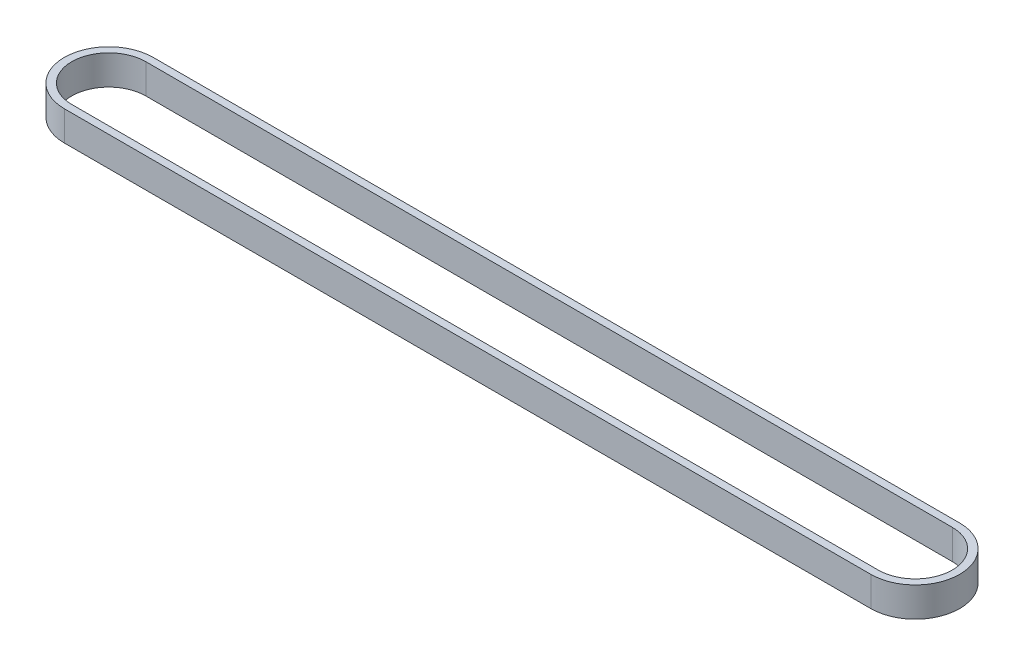
ISO-10303-21;
HEADER;
FILE_DESCRIPTION(('STEP AP214'),'2;1');
FILE_NAME('part.step','',(''),(''),'','','');
FILE_SCHEMA(('AUTOMOTIVE_DESIGN { 1 0 10303 214 1 1 1 1 }'));
ENDSEC;
DATA;
#1=APPLICATION_CONTEXT('core data for automotive mechanical design processes');
#2=APPLICATION_PROTOCOL_DEFINITION('international standard','automotive_design',2000,#1);
#3=PRODUCT_CONTEXT('',#1,'mechanical');
#4=PRODUCT('Part','Part','',(#3));
#5=PRODUCT_RELATED_PRODUCT_CATEGORY('part','',(#4));
#6=PRODUCT_DEFINITION_FORMATION('','',#4);
#7=PRODUCT_DEFINITION_CONTEXT('part definition',#1,'design');
#8=PRODUCT_DEFINITION('design','',#6,#7);
#9=PRODUCT_DEFINITION_SHAPE('','',#8);
#10=(LENGTH_UNIT() NAMED_UNIT(*) SI_UNIT(.MILLI.,.METRE.));
#11=(NAMED_UNIT(*) PLANE_ANGLE_UNIT() SI_UNIT($,.RADIAN.));
#12=(NAMED_UNIT(*) SI_UNIT($,.STERADIAN.) SOLID_ANGLE_UNIT());
#13=UNCERTAINTY_MEASURE_WITH_UNIT(LENGTH_MEASURE(1.E-05),#10,'distance_accuracy_value','');
#14=(GEOMETRIC_REPRESENTATION_CONTEXT(3) GLOBAL_UNCERTAINTY_ASSIGNED_CONTEXT((#13)) GLOBAL_UNIT_ASSIGNED_CONTEXT((#10,
#11,#12)) REPRESENTATION_CONTEXT('',''));
#15=CARTESIAN_POINT('',(0.,0.,0.));
#16=DIRECTION('',(0.,0.,1.));
#17=DIRECTION('',(1.,0.,0.));
#18=AXIS2_PLACEMENT_3D('',#15,#16,#17);
#19=CARTESIAN_POINT('',(0.,8.,0.));
#20=DIRECTION('',(0.,-1.,0.));
#21=DIRECTION('',(0.,0.,-1.));
#22=AXIS2_PLACEMENT_3D('',#19,#20,#21);
#23=CYLINDRICAL_SURFACE('',#22,11.975);
#24=CARTESIAN_POINT('',(0.,0.,0.));
#25=DIRECTION('',(0.,1.,0.));
#26=DIRECTION('',(0.,0.,1.));
#27=AXIS2_PLACEMENT_3D('',#24,#25,#26);
#28=CIRCLE('',#27,11.975);
#29=CARTESIAN_POINT('',(0.,0.,-11.975));
#30=VERTEX_POINT('',#29);
#31=CARTESIAN_POINT('',(0.,0.,11.975));
#32=VERTEX_POINT('',#31);
#33=EDGE_CURVE('E128',#30,#32,#28,.T.);
#34=ORIENTED_EDGE('',*,*,#33,.T.);
#35=DIRECTION('',(0.,-1.,0.));
#36=VECTOR('',#35,1.);
#37=CARTESIAN_POINT('',(0.,8.,11.975));
#38=LINE('',#37,#36);
#39=CARTESIAN_POINT('',(0.,8.,11.975));
#40=VERTEX_POINT('',#39);
#41=EDGE_CURVE('E11',#40,#32,#38,.T.);
#42=ORIENTED_EDGE('',*,*,#41,.F.);
#43=CARTESIAN_POINT('',(0.,8.,0.));
#44=DIRECTION('',(0.,1.,0.));
#45=DIRECTION('',(0.,0.,1.));
#46=AXIS2_PLACEMENT_3D('',#43,#44,#45);
#47=CIRCLE('',#46,11.975);
#48=CARTESIAN_POINT('',(0.,8.,-11.975));
#49=VERTEX_POINT('',#48);
#50=EDGE_CURVE('E132',#49,#40,#47,.T.);
#51=ORIENTED_EDGE('',*,*,#50,.F.);
#52=DIRECTION('',(0.,-1.,0.));
#53=VECTOR('',#52,1.);
#54=CARTESIAN_POINT('',(0.,8.,-11.975));
#55=LINE('',#54,#53);
#56=EDGE_CURVE('E142',#49,#30,#55,.T.);
#57=ORIENTED_EDGE('',*,*,#56,.T.);
#58=EDGE_LOOP('',(#34,#42,#51,#57));
#59=FACE_BOUND('',#58,.T.);
#60=ADVANCED_FACE('F31',(#59),#23,.T.);
#61=CARTESIAN_POINT('',(0.,8.,11.975));
#62=DIRECTION('',(0.,0.,-1.));
#63=DIRECTION('',(-1.,0.,0.));
#64=AXIS2_PLACEMENT_3D('',#61,#62,#63);
#65=PLANE('',#64);
#66=DIRECTION('',(1.,0.,0.));
#67=VECTOR('',#66,1.);
#68=CARTESIAN_POINT('',(0.,0.,11.975));
#69=LINE('',#68,#67);
#70=CARTESIAN_POINT('',(217.26,0.,11.975));
#71=VERTEX_POINT('',#70);
#72=EDGE_CURVE('E145',#32,#71,#69,.T.);
#73=ORIENTED_EDGE('',*,*,#72,.T.);
#74=DIRECTION('',(0.,-1.,0.));
#75=VECTOR('',#74,1.);
#76=CARTESIAN_POINT('',(217.26,8.,11.975));
#77=LINE('',#76,#75);
#78=CARTESIAN_POINT('',(217.26,8.,11.975));
#79=VERTEX_POINT('',#78);
#80=EDGE_CURVE('E38',#79,#71,#77,.T.);
#81=ORIENTED_EDGE('',*,*,#80,.F.);
#82=DIRECTION('',(1.,0.,0.));
#83=VECTOR('',#82,1.);
#84=CARTESIAN_POINT('',(0.,8.,11.975));
#85=LINE('',#84,#83);
#86=EDGE_CURVE('E135',#40,#79,#85,.T.);
#87=ORIENTED_EDGE('',*,*,#86,.F.);
#88=ORIENTED_EDGE('',*,*,#41,.T.);
#89=EDGE_LOOP('',(#73,#81,#87,#88));
#90=FACE_BOUND('',#89,.T.);
#91=ADVANCED_FACE('F173',(#90),#65,.F.);
#92=CARTESIAN_POINT('',(217.26,8.,0.));
#93=DIRECTION('',(0.,-1.,0.));
#94=DIRECTION('',(0.,0.,-1.));
#95=AXIS2_PLACEMENT_3D('',#92,#93,#94);
#96=CYLINDRICAL_SURFACE('',#95,11.975);
#97=CARTESIAN_POINT('',(217.26,0.,0.));
#98=DIRECTION('',(0.,1.,0.));
#99=DIRECTION('',(0.,0.,1.));
#100=AXIS2_PLACEMENT_3D('',#97,#98,#99);
#101=CIRCLE('',#100,11.975);
#102=CARTESIAN_POINT('',(217.26,0.,-11.975));
#103=VERTEX_POINT('',#102);
#104=EDGE_CURVE('E147',#71,#103,#101,.T.);
#105=ORIENTED_EDGE('',*,*,#104,.T.);
#106=DIRECTION('',(0.,-1.,0.));
#107=VECTOR('',#106,1.);
#108=CARTESIAN_POINT('',(217.26,8.,-11.975));
#109=LINE('',#108,#107);
#110=CARTESIAN_POINT('',(217.26,8.,-11.975));
#111=VERTEX_POINT('',#110);
#112=EDGE_CURVE('E152',#111,#103,#109,.T.);
#113=ORIENTED_EDGE('',*,*,#112,.F.);
#114=CARTESIAN_POINT('',(217.26,8.,0.));
#115=DIRECTION('',(0.,1.,0.));
#116=DIRECTION('',(0.,0.,1.));
#117=AXIS2_PLACEMENT_3D('',#114,#115,#116);
#118=CIRCLE('',#117,11.975);
#119=EDGE_CURVE('E138',#79,#111,#118,.T.);
#120=ORIENTED_EDGE('',*,*,#119,.F.);
#121=ORIENTED_EDGE('',*,*,#80,.T.);
#122=EDGE_LOOP('',(#105,#113,#120,#121));
#123=FACE_BOUND('',#122,.T.);
#124=ADVANCED_FACE('F159',(#123),#96,.T.);
#125=CARTESIAN_POINT('',(0.,8.,-11.975));
#126=DIRECTION('',(0.,0.,1.));
#127=DIRECTION('',(1.,0.,0.));
#128=AXIS2_PLACEMENT_3D('',#125,#126,#127);
#129=PLANE('',#128);
#130=DIRECTION('',(-1.,0.,0.));
#131=VECTOR('',#130,1.);
#132=CARTESIAN_POINT('',(0.,0.,-11.975));
#133=LINE('',#132,#131);
#134=EDGE_CURVE('E136',#103,#30,#133,.T.);
#135=ORIENTED_EDGE('',*,*,#134,.T.);
#136=ORIENTED_EDGE('',*,*,#56,.F.);
#137=DIRECTION('',(-1.,0.,0.));
#138=VECTOR('',#137,1.);
#139=CARTESIAN_POINT('',(0.,8.,-11.975));
#140=LINE('',#139,#138);
#141=EDGE_CURVE('E140',#111,#49,#140,.T.);
#142=ORIENTED_EDGE('',*,*,#141,.F.);
#143=ORIENTED_EDGE('',*,*,#112,.T.);
#144=EDGE_LOOP('',(#135,#136,#142,#143));
#145=FACE_BOUND('',#144,.T.);
#146=ADVANCED_FACE('F166',(#145),#129,.F.);
#147=CARTESIAN_POINT('',(0.,8.,0.));
#148=DIRECTION('',(0.,1.,0.));
#149=DIRECTION('',(0.,0.,1.));
#150=AXIS2_PLACEMENT_3D('',#147,#148,#149);
#151=PLANE('',#150);
#152=CARTESIAN_POINT('',(0.,8.,0.));
#153=DIRECTION('',(0.,1.,0.));
#154=DIRECTION('',(0.,0.,1.));
#155=AXIS2_PLACEMENT_3D('',#152,#153,#154);
#156=CIRCLE('',#155,9.975);
#157=CARTESIAN_POINT('',(0.,8.,-9.975));
#158=VERTEX_POINT('',#157);
#159=CARTESIAN_POINT('',(0.,8.,9.975));
#160=VERTEX_POINT('',#159);
#161=EDGE_CURVE('E45',#158,#160,#156,.T.);
#162=ORIENTED_EDGE('',*,*,#161,.F.);
#163=DIRECTION('',(-1.,0.,0.));
#164=VECTOR('',#163,1.);
#165=CARTESIAN_POINT('',(0.,8.,-9.975));
#166=LINE('',#165,#164);
#167=CARTESIAN_POINT('',(217.26,8.,-9.975));
#168=VERTEX_POINT('',#167);
#169=EDGE_CURVE('E113',#168,#158,#166,.T.);
#170=ORIENTED_EDGE('',*,*,#169,.F.);
#171=CARTESIAN_POINT('',(217.26,8.,0.));
#172=DIRECTION('',(0.,1.,0.));
#173=DIRECTION('',(0.,0.,1.));
#174=AXIS2_PLACEMENT_3D('',#171,#172,#173);
#175=CIRCLE('',#174,9.975);
#176=CARTESIAN_POINT('',(217.26,8.,9.975));
#177=VERTEX_POINT('',#176);
#178=EDGE_CURVE('E116',#177,#168,#175,.T.);
#179=ORIENTED_EDGE('',*,*,#178,.F.);
#180=DIRECTION('',(1.,0.,0.));
#181=VECTOR('',#180,1.);
#182=CARTESIAN_POINT('',(0.,8.,9.975));
#183=LINE('',#182,#181);
#184=EDGE_CURVE('E122',#160,#177,#183,.T.);
#185=ORIENTED_EDGE('',*,*,#184,.F.);
#186=EDGE_LOOP('',(#162,#170,#179,#185));
#187=FACE_BOUND('',#186,.T.);
#188=ORIENTED_EDGE('',*,*,#50,.T.);
#189=ORIENTED_EDGE('',*,*,#86,.T.);
#190=ORIENTED_EDGE('',*,*,#119,.T.);
#191=ORIENTED_EDGE('',*,*,#141,.T.);
#192=EDGE_LOOP('',(#188,#189,#190,#191));
#193=FACE_BOUND('',#192,.T.);
#194=ADVANCED_FACE('F172',(#187,#193),#151,.T.);
#195=CARTESIAN_POINT('',(0.,0.,0.));
#196=DIRECTION('',(0.,1.,0.));
#197=DIRECTION('',(0.,0.,1.));
#198=AXIS2_PLACEMENT_3D('',#195,#196,#197);
#199=PLANE('',#198);
#200=DIRECTION('',(-1.,0.,0.));
#201=VECTOR('',#200,1.);
#202=CARTESIAN_POINT('',(0.,0.,-9.975));
#203=LINE('',#202,#201);
#204=CARTESIAN_POINT('',(217.26,0.,-9.975));
#205=VERTEX_POINT('',#204);
#206=CARTESIAN_POINT('',(0.,0.,-9.975));
#207=VERTEX_POINT('',#206);
#208=EDGE_CURVE('E103',#205,#207,#203,.T.);
#209=ORIENTED_EDGE('',*,*,#208,.T.);
#210=CARTESIAN_POINT('',(0.,0.,0.));
#211=DIRECTION('',(0.,1.,0.));
#212=DIRECTION('',(0.,0.,1.));
#213=AXIS2_PLACEMENT_3D('',#210,#211,#212);
#214=CIRCLE('',#213,9.975);
#215=CARTESIAN_POINT('',(0.,0.,9.975));
#216=VERTEX_POINT('',#215);
#217=EDGE_CURVE('E97',#207,#216,#214,.T.);
#218=ORIENTED_EDGE('',*,*,#217,.T.);
#219=DIRECTION('',(1.,0.,0.));
#220=VECTOR('',#219,1.);
#221=CARTESIAN_POINT('',(0.,0.,9.975));
#222=LINE('',#221,#220);
#223=CARTESIAN_POINT('',(217.26,0.,9.975));
#224=VERTEX_POINT('',#223);
#225=EDGE_CURVE('E106',#216,#224,#222,.T.);
#226=ORIENTED_EDGE('',*,*,#225,.T.);
#227=CARTESIAN_POINT('',(217.26,0.,0.));
#228=DIRECTION('',(0.,1.,0.));
#229=DIRECTION('',(0.,0.,1.));
#230=AXIS2_PLACEMENT_3D('',#227,#228,#229);
#231=CIRCLE('',#230,9.975);
#232=EDGE_CURVE('E53',#224,#205,#231,.T.);
#233=ORIENTED_EDGE('',*,*,#232,.T.);
#234=EDGE_LOOP('',(#209,#218,#226,#233));
#235=FACE_BOUND('',#234,.T.);
#236=ORIENTED_EDGE('',*,*,#33,.F.);
#237=ORIENTED_EDGE('',*,*,#134,.F.);
#238=ORIENTED_EDGE('',*,*,#104,.F.);
#239=ORIENTED_EDGE('',*,*,#72,.F.);
#240=EDGE_LOOP('',(#236,#237,#238,#239));
#241=FACE_BOUND('',#240,.T.);
#242=ADVANCED_FACE('F110',(#235,#241),#199,.F.);
#243=CARTESIAN_POINT('',(0.,0.,0.));
#244=DIRECTION('',(0.,1.,0.));
#245=DIRECTION('',(0.,0.,1.));
#246=AXIS2_PLACEMENT_3D('',#243,#244,#245);
#247=CYLINDRICAL_SURFACE('',#246,9.975);
#248=ORIENTED_EDGE('',*,*,#161,.T.);
#249=DIRECTION('',(0.,1.,0.));
#250=VECTOR('',#249,1.);
#251=CARTESIAN_POINT('',(0.,0.,9.975));
#252=LINE('',#251,#250);
#253=EDGE_CURVE('E93',#216,#160,#252,.T.);
#254=ORIENTED_EDGE('',*,*,#253,.F.);
#255=ORIENTED_EDGE('',*,*,#217,.F.);
#256=DIRECTION('',(0.,1.,0.));
#257=VECTOR('',#256,1.);
#258=CARTESIAN_POINT('',(0.,0.,-9.975));
#259=LINE('',#258,#257);
#260=EDGE_CURVE('E126',#207,#158,#259,.T.);
#261=ORIENTED_EDGE('',*,*,#260,.T.);
#262=EDGE_LOOP('',(#248,#254,#255,#261));
#263=FACE_BOUND('',#262,.T.);
#264=ADVANCED_FACE('F95',(#263),#247,.F.);
#265=CARTESIAN_POINT('',(0.,0.,-9.975));
#266=DIRECTION('',(0.,0.,-1.));
#267=DIRECTION('',(-1.,0.,0.));
#268=AXIS2_PLACEMENT_3D('',#265,#266,#267);
#269=PLANE('',#268);
#270=ORIENTED_EDGE('',*,*,#169,.T.);
#271=ORIENTED_EDGE('',*,*,#260,.F.);
#272=ORIENTED_EDGE('',*,*,#208,.F.);
#273=DIRECTION('',(0.,1.,0.));
#274=VECTOR('',#273,1.);
#275=CARTESIAN_POINT('',(217.26,0.,-9.975));
#276=LINE('',#275,#274);
#277=EDGE_CURVE('E129',#205,#168,#276,.T.);
#278=ORIENTED_EDGE('',*,*,#277,.T.);
#279=EDGE_LOOP('',(#270,#271,#272,#278));
#280=FACE_BOUND('',#279,.T.);
#281=ADVANCED_FACE('F190',(#280),#269,.F.);
#282=CARTESIAN_POINT('',(217.26,0.,0.));
#283=DIRECTION('',(0.,1.,0.));
#284=DIRECTION('',(0.,0.,1.));
#285=AXIS2_PLACEMENT_3D('',#282,#283,#284);
#286=CYLINDRICAL_SURFACE('',#285,9.975);
#287=ORIENTED_EDGE('',*,*,#178,.T.);
#288=ORIENTED_EDGE('',*,*,#277,.F.);
#289=ORIENTED_EDGE('',*,*,#232,.F.);
#290=DIRECTION('',(0.,1.,0.));
#291=VECTOR('',#290,1.);
#292=CARTESIAN_POINT('',(217.26,0.,9.975));
#293=LINE('',#292,#291);
#294=EDGE_CURVE('E102',#224,#177,#293,.T.);
#295=ORIENTED_EDGE('',*,*,#294,.T.);
#296=EDGE_LOOP('',(#287,#288,#289,#295));
#297=FACE_BOUND('',#296,.T.);
#298=ADVANCED_FACE('F193',(#297),#286,.F.);
#299=CARTESIAN_POINT('',(0.,0.,9.975));
#300=DIRECTION('',(0.,0.,1.));
#301=DIRECTION('',(1.,0.,0.));
#302=AXIS2_PLACEMENT_3D('',#299,#300,#301);
#303=PLANE('',#302);
#304=ORIENTED_EDGE('',*,*,#184,.T.);
#305=ORIENTED_EDGE('',*,*,#294,.F.);
#306=ORIENTED_EDGE('',*,*,#225,.F.);
#307=ORIENTED_EDGE('',*,*,#253,.T.);
#308=EDGE_LOOP('',(#304,#305,#306,#307));
#309=FACE_BOUND('',#308,.T.);
#310=ADVANCED_FACE('F107',(#309),#303,.F.);
#311=CLOSED_SHELL('',(#60,#91,#124,#146,#194,#242,#264,#281,#298,#310));
#312=MANIFOLD_SOLID_BREP('B2',#311);
#313=ADVANCED_BREP_SHAPE_REPRESENTATION('',(#18,#312),#14);
#314=SHAPE_DEFINITION_REPRESENTATION(#9,#313);
ENDSEC;
END-ISO-10303-21;
